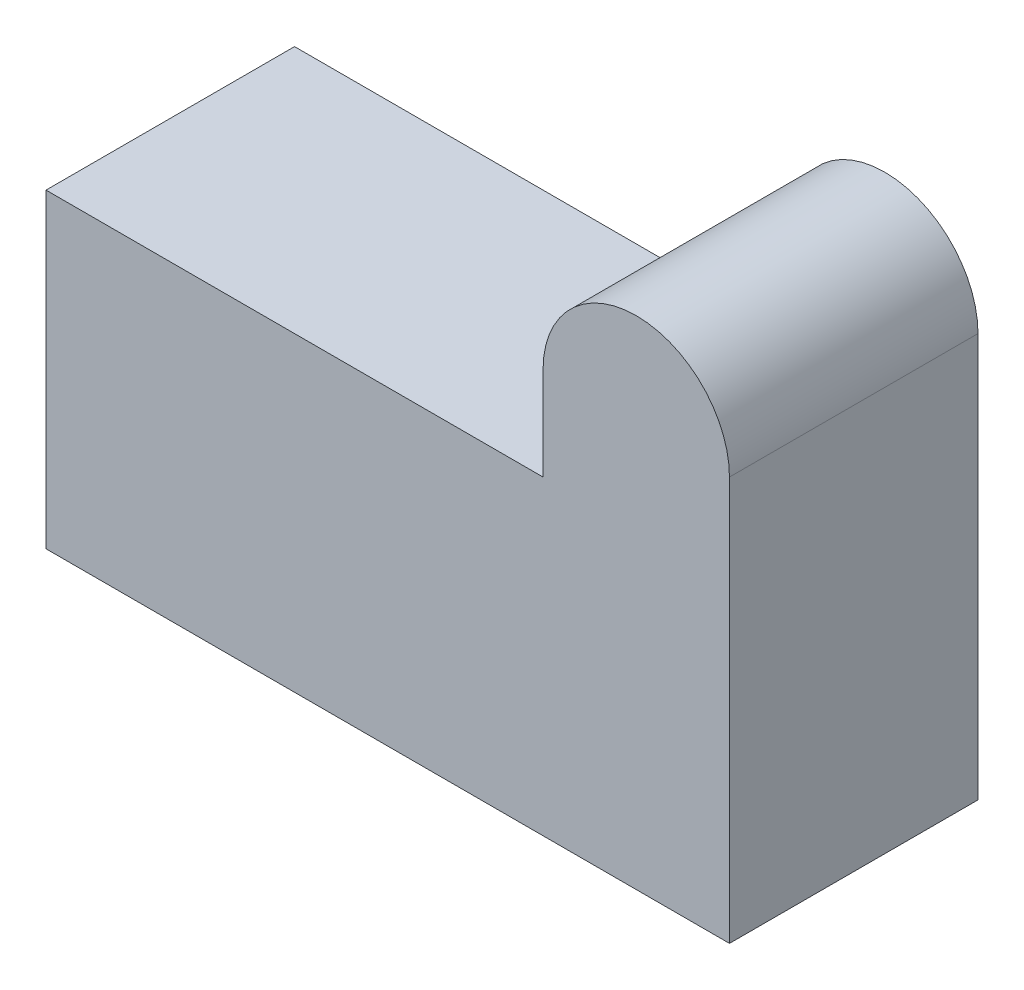
ISO-10303-21;
HEADER;
FILE_DESCRIPTION(('STEP AP214'),'2;1');
FILE_NAME('part.step','',(''),(''),'','','');
FILE_SCHEMA(('AUTOMOTIVE_DESIGN { 1 0 10303 214 1 1 1 1 }'));
ENDSEC;
DATA;
#1=APPLICATION_CONTEXT('core data for automotive mechanical design processes');
#2=APPLICATION_PROTOCOL_DEFINITION('international standard','automotive_design',2000,#1);
#3=PRODUCT_CONTEXT('',#1,'mechanical');
#4=PRODUCT('Part','Part','',(#3));
#5=PRODUCT_RELATED_PRODUCT_CATEGORY('part','',(#4));
#6=PRODUCT_DEFINITION_FORMATION('','',#4);
#7=PRODUCT_DEFINITION_CONTEXT('part definition',#1,'design');
#8=PRODUCT_DEFINITION('design','',#6,#7);
#9=PRODUCT_DEFINITION_SHAPE('','',#8);
#10=(LENGTH_UNIT() NAMED_UNIT(*) SI_UNIT(.MILLI.,.METRE.));
#11=(NAMED_UNIT(*) PLANE_ANGLE_UNIT() SI_UNIT($,.RADIAN.));
#12=(NAMED_UNIT(*) SI_UNIT($,.STERADIAN.) SOLID_ANGLE_UNIT());
#13=UNCERTAINTY_MEASURE_WITH_UNIT(LENGTH_MEASURE(1.E-05),#10,'distance_accuracy_value','');
#14=(GEOMETRIC_REPRESENTATION_CONTEXT(3) GLOBAL_UNCERTAINTY_ASSIGNED_CONTEXT((#13)) GLOBAL_UNIT_ASSIGNED_CONTEXT((#10,
#11,#12)) REPRESENTATION_CONTEXT('',''));
#15=CARTESIAN_POINT('',(0.,0.,0.));
#16=DIRECTION('',(0.,0.,1.));
#17=DIRECTION('',(1.,0.,0.));
#18=AXIS2_PLACEMENT_3D('',#15,#16,#17);
#19=CARTESIAN_POINT('',(-1.1,0.7,0.));
#20=DIRECTION('',(-1.,0.,0.));
#21=DIRECTION('',(0.,-1.,0.));
#22=AXIS2_PLACEMENT_3D('',#19,#20,#21);
#23=PLANE('',#22);
#24=DIRECTION('',(0.,-1.,0.));
#25=VECTOR('',#24,1.);
#26=CARTESIAN_POINT('',(-1.1,0.7,0.));
#27=LINE('',#26,#25);
#28=CARTESIAN_POINT('',(-1.1,0.7,0.));
#29=VERTEX_POINT('',#28);
#30=CARTESIAN_POINT('',(-1.1,0.625,0.));
#31=VERTEX_POINT('',#30);
#32=EDGE_CURVE('E11',#29,#31,#27,.T.);
#33=ORIENTED_EDGE('',*,*,#32,.T.);
#34=DIRECTION('',(0.,0.,1.));
#35=VECTOR('',#34,1.);
#36=CARTESIAN_POINT('',(-1.1,0.625,0.));
#37=LINE('',#36,#35);
#38=CARTESIAN_POINT('',(-1.1,0.625,0.2));
#39=VERTEX_POINT('',#38);
#40=EDGE_CURVE('E24',#31,#39,#37,.T.);
#41=ORIENTED_EDGE('',*,*,#40,.T.);
#42=DIRECTION('',(0.,-1.,0.));
#43=VECTOR('',#42,1.);
#44=CARTESIAN_POINT('',(-1.1,0.7,0.2));
#45=LINE('',#44,#43);
#46=CARTESIAN_POINT('',(-1.1,0.7,0.2));
#47=VERTEX_POINT('',#46);
#48=EDGE_CURVE('E88',#47,#39,#45,.T.);
#49=ORIENTED_EDGE('',*,*,#48,.F.);
#50=DIRECTION('',(0.,0.,1.));
#51=VECTOR('',#50,1.);
#52=CARTESIAN_POINT('',(-1.1,0.7,0.));
#53=LINE('',#52,#51);
#54=EDGE_CURVE('E116',#29,#47,#53,.T.);
#55=ORIENTED_EDGE('',*,*,#54,.F.);
#56=EDGE_LOOP('',(#33,#41,#49,#55));
#57=FACE_BOUND('',#56,.T.);
#58=ADVANCED_FACE('F17',(#57),#23,.T.);
#59=CARTESIAN_POINT('',(-1.025,0.7,0.));
#60=DIRECTION('',(0.,0.,1.));
#61=DIRECTION('',(1.,0.,0.));
#62=AXIS2_PLACEMENT_3D('',#59,#60,#61);
#63=CYLINDRICAL_SURFACE('',#62,0.0749999999999999);
#64=CARTESIAN_POINT('',(-1.025,0.7,0.));
#65=DIRECTION('',(0.,0.,1.));
#66=DIRECTION('',(1.,0.,0.));
#67=AXIS2_PLACEMENT_3D('',#64,#65,#66);
#68=CIRCLE('',#67,0.0749999999999999);
#69=CARTESIAN_POINT('',(-0.95,0.7,0.));
#70=VERTEX_POINT('',#69);
#71=EDGE_CURVE('E113',#70,#29,#68,.T.);
#72=ORIENTED_EDGE('',*,*,#71,.T.);
#73=ORIENTED_EDGE('',*,*,#54,.T.);
#74=CARTESIAN_POINT('',(-1.025,0.7,0.2));
#75=DIRECTION('',(0.,0.,1.));
#76=DIRECTION('',(1.,0.,0.));
#77=AXIS2_PLACEMENT_3D('',#74,#75,#76);
#78=CIRCLE('',#77,0.0749999999999999);
#79=CARTESIAN_POINT('',(-0.95,0.7,0.2));
#80=VERTEX_POINT('',#79);
#81=EDGE_CURVE('E111',#80,#47,#78,.T.);
#82=ORIENTED_EDGE('',*,*,#81,.F.);
#83=DIRECTION('',(0.,0.,1.));
#84=VECTOR('',#83,1.);
#85=CARTESIAN_POINT('',(-0.95,0.7,0.));
#86=LINE('',#85,#84);
#87=EDGE_CURVE('E108',#70,#80,#86,.T.);
#88=ORIENTED_EDGE('',*,*,#87,.F.);
#89=EDGE_LOOP('',(#72,#73,#82,#88));
#90=FACE_BOUND('',#89,.T.);
#91=ADVANCED_FACE('F127',(#90),#63,.T.);
#92=CARTESIAN_POINT('',(-0.950000000000001,0.375,0.));
#93=DIRECTION('',(1.,0.,0.));
#94=DIRECTION('',(0.,1.,0.));
#95=AXIS2_PLACEMENT_3D('',#92,#93,#94);
#96=PLANE('',#95);
#97=DIRECTION('',(0.,1.,0.));
#98=VECTOR('',#97,1.);
#99=CARTESIAN_POINT('',(-0.950000000000001,0.375,0.));
#100=LINE('',#99,#98);
#101=CARTESIAN_POINT('',(-0.950000000000001,0.375,0.));
#102=VERTEX_POINT('',#101);
#103=EDGE_CURVE('E105',#102,#70,#100,.T.);
#104=ORIENTED_EDGE('',*,*,#103,.T.);
#105=ORIENTED_EDGE('',*,*,#87,.T.);
#106=DIRECTION('',(0.,1.,0.));
#107=VECTOR('',#106,1.);
#108=CARTESIAN_POINT('',(-0.950000000000001,0.375,0.2));
#109=LINE('',#108,#107);
#110=CARTESIAN_POINT('',(-0.950000000000001,0.375,0.2));
#111=VERTEX_POINT('',#110);
#112=EDGE_CURVE('E102',#111,#80,#109,.T.);
#113=ORIENTED_EDGE('',*,*,#112,.F.);
#114=DIRECTION('',(0.,0.,1.));
#115=VECTOR('',#114,1.);
#116=CARTESIAN_POINT('',(-0.950000000000001,0.375,0.));
#117=LINE('',#116,#115);
#118=EDGE_CURVE('E99',#102,#111,#117,.T.);
#119=ORIENTED_EDGE('',*,*,#118,.F.);
#120=EDGE_LOOP('',(#104,#105,#113,#119));
#121=FACE_BOUND('',#120,.T.);
#122=ADVANCED_FACE('F124',(#121),#96,.T.);
#123=CARTESIAN_POINT('',(-1.5,0.375,0.));
#124=DIRECTION('',(0.,-1.,0.));
#125=DIRECTION('',(1.,0.,0.));
#126=AXIS2_PLACEMENT_3D('',#123,#124,#125);
#127=PLANE('',#126);
#128=DIRECTION('',(1.,0.,0.));
#129=VECTOR('',#128,1.);
#130=CARTESIAN_POINT('',(-1.5,0.375,0.));
#131=LINE('',#130,#129);
#132=CARTESIAN_POINT('',(-1.5,0.375,0.));
#133=VERTEX_POINT('',#132);
#134=EDGE_CURVE('E96',#133,#102,#131,.T.);
#135=ORIENTED_EDGE('',*,*,#134,.T.);
#136=ORIENTED_EDGE('',*,*,#118,.T.);
#137=DIRECTION('',(1.,0.,0.));
#138=VECTOR('',#137,1.);
#139=CARTESIAN_POINT('',(-1.5,0.375,0.2));
#140=LINE('',#139,#138);
#141=CARTESIAN_POINT('',(-1.5,0.375,0.2));
#142=VERTEX_POINT('',#141);
#143=EDGE_CURVE('E94',#142,#111,#140,.T.);
#144=ORIENTED_EDGE('',*,*,#143,.F.);
#145=DIRECTION('',(0.,0.,1.));
#146=VECTOR('',#145,1.);
#147=CARTESIAN_POINT('',(-1.5,0.375,0.));
#148=LINE('',#147,#146);
#149=EDGE_CURVE('E73',#133,#142,#148,.T.);
#150=ORIENTED_EDGE('',*,*,#149,.F.);
#151=EDGE_LOOP('',(#135,#136,#144,#150));
#152=FACE_BOUND('',#151,.T.);
#153=ADVANCED_FACE('F122',(#152),#127,.T.);
#154=CARTESIAN_POINT('',(-1.5,0.625,0.));
#155=DIRECTION('',(-1.,0.,0.));
#156=DIRECTION('',(0.,-1.,0.));
#157=AXIS2_PLACEMENT_3D('',#154,#155,#156);
#158=PLANE('',#157);
#159=DIRECTION('',(0.,-1.,0.));
#160=VECTOR('',#159,1.);
#161=CARTESIAN_POINT('',(-1.5,0.625,0.));
#162=LINE('',#161,#160);
#163=CARTESIAN_POINT('',(-1.5,0.625,0.));
#164=VERTEX_POINT('',#163);
#165=EDGE_CURVE('E77',#164,#133,#162,.T.);
#166=ORIENTED_EDGE('',*,*,#165,.T.);
#167=ORIENTED_EDGE('',*,*,#149,.T.);
#168=DIRECTION('',(0.,-1.,0.));
#169=VECTOR('',#168,1.);
#170=CARTESIAN_POINT('',(-1.5,0.625,0.2));
#171=LINE('',#170,#169);
#172=CARTESIAN_POINT('',(-1.5,0.625,0.2));
#173=VERTEX_POINT('',#172);
#174=EDGE_CURVE('E66',#173,#142,#171,.T.);
#175=ORIENTED_EDGE('',*,*,#174,.F.);
#176=DIRECTION('',(0.,0.,1.));
#177=VECTOR('',#176,1.);
#178=CARTESIAN_POINT('',(-1.5,0.625,0.));
#179=LINE('',#178,#177);
#180=EDGE_CURVE('E70',#164,#173,#179,.T.);
#181=ORIENTED_EDGE('',*,*,#180,.F.);
#182=EDGE_LOOP('',(#166,#167,#175,#181));
#183=FACE_BOUND('',#182,.T.);
#184=ADVANCED_FACE('F69',(#183),#158,.T.);
#185=CARTESIAN_POINT('',(-1.1,0.625,0.));
#186=DIRECTION('',(0.,1.,0.));
#187=DIRECTION('',(-1.,0.,0.));
#188=AXIS2_PLACEMENT_3D('',#185,#186,#187);
#189=PLANE('',#188);
#190=DIRECTION('',(-1.,0.,0.));
#191=VECTOR('',#190,1.);
#192=CARTESIAN_POINT('',(-1.225,0.625,0.));
#193=LINE('',#192,#191);
#194=EDGE_CURVE('E83',#31,#164,#193,.T.);
#195=ORIENTED_EDGE('',*,*,#194,.T.);
#196=ORIENTED_EDGE('',*,*,#180,.T.);
#197=DIRECTION('',(-1.,0.,0.));
#198=VECTOR('',#197,1.);
#199=CARTESIAN_POINT('',(-1.225,0.625,0.2));
#200=LINE('',#199,#198);
#201=EDGE_CURVE('E82',#39,#173,#200,.T.);
#202=ORIENTED_EDGE('',*,*,#201,.F.);
#203=ORIENTED_EDGE('',*,*,#40,.F.);
#204=EDGE_LOOP('',(#195,#196,#202,#203));
#205=FACE_BOUND('',#204,.T.);
#206=ADVANCED_FACE('F81',(#205),#189,.T.);
#207=CARTESIAN_POINT('',(-1.3,0.5,0.2));
#208=DIRECTION('',(0.,0.,1.));
#209=DIRECTION('',(1.,0.,0.));
#210=AXIS2_PLACEMENT_3D('',#207,#208,#209);
#211=PLANE('',#210);
#212=ORIENTED_EDGE('',*,*,#201,.T.);
#213=ORIENTED_EDGE('',*,*,#174,.T.);
#214=ORIENTED_EDGE('',*,*,#143,.T.);
#215=ORIENTED_EDGE('',*,*,#112,.T.);
#216=ORIENTED_EDGE('',*,*,#81,.T.);
#217=ORIENTED_EDGE('',*,*,#48,.T.);
#218=EDGE_LOOP('',(#212,#213,#214,#215,#216,#217));
#219=FACE_BOUND('',#218,.T.);
#220=ADVANCED_FACE('F86',(#219),#211,.T.);
#221=CARTESIAN_POINT('',(-1.3,0.5,0.));
#222=DIRECTION('',(0.,0.,1.));
#223=DIRECTION('',(1.,0.,0.));
#224=AXIS2_PLACEMENT_3D('',#221,#222,#223);
#225=PLANE('',#224);
#226=ORIENTED_EDGE('',*,*,#194,.F.);
#227=ORIENTED_EDGE('',*,*,#32,.F.);
#228=ORIENTED_EDGE('',*,*,#71,.F.);
#229=ORIENTED_EDGE('',*,*,#103,.F.);
#230=ORIENTED_EDGE('',*,*,#134,.F.);
#231=ORIENTED_EDGE('',*,*,#165,.F.);
#232=EDGE_LOOP('',(#226,#227,#228,#229,#230,#231));
#233=FACE_BOUND('',#232,.T.);
#234=ADVANCED_FACE('F119',(#233),#225,.F.);
#235=CLOSED_SHELL('',(#58,#91,#122,#153,#184,#206,#220,#234));
#236=MANIFOLD_SOLID_BREP('B1',#235);
#237=ADVANCED_BREP_SHAPE_REPRESENTATION('',(#18,#236),#14);
#238=SHAPE_DEFINITION_REPRESENTATION(#9,#237);
ENDSEC;
END-ISO-10303-21;
